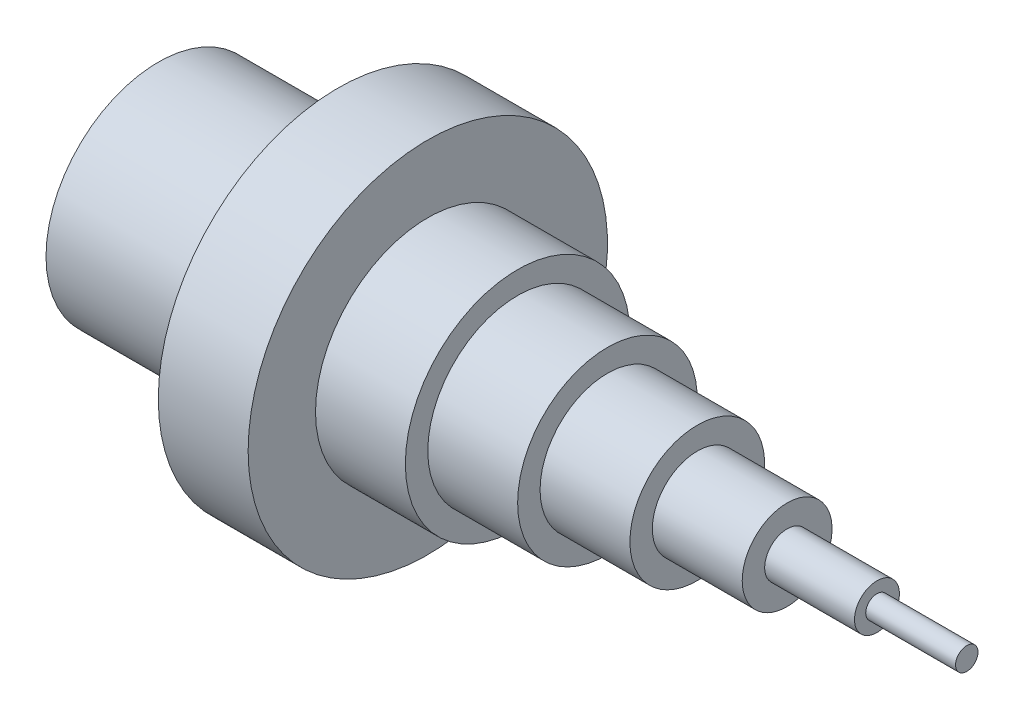
ISO-10303-21;
HEADER;
FILE_DESCRIPTION(('STEP AP214'),'2;1');
FILE_NAME('part.step','',(''),(''),'','','');
FILE_SCHEMA(('AUTOMOTIVE_DESIGN { 1 0 10303 214 1 1 1 1 }'));
ENDSEC;
DATA;
#1=APPLICATION_CONTEXT('core data for automotive mechanical design processes');
#2=APPLICATION_PROTOCOL_DEFINITION('international standard','automotive_design',2000,#1);
#3=PRODUCT_CONTEXT('',#1,'mechanical');
#4=PRODUCT('Part','Part','',(#3));
#5=PRODUCT_RELATED_PRODUCT_CATEGORY('part','',(#4));
#6=PRODUCT_DEFINITION_FORMATION('','',#4);
#7=PRODUCT_DEFINITION_CONTEXT('part definition',#1,'design');
#8=PRODUCT_DEFINITION('design','',#6,#7);
#9=PRODUCT_DEFINITION_SHAPE('','',#8);
#10=(LENGTH_UNIT() NAMED_UNIT(*) SI_UNIT(.MILLI.,.METRE.));
#11=(NAMED_UNIT(*) PLANE_ANGLE_UNIT() SI_UNIT($,.RADIAN.));
#12=(NAMED_UNIT(*) SI_UNIT($,.STERADIAN.) SOLID_ANGLE_UNIT());
#13=UNCERTAINTY_MEASURE_WITH_UNIT(LENGTH_MEASURE(1.E-05),#10,'distance_accuracy_value','');
#14=(GEOMETRIC_REPRESENTATION_CONTEXT(3) GLOBAL_UNCERTAINTY_ASSIGNED_CONTEXT((#13)) GLOBAL_UNIT_ASSIGNED_CONTEXT((#10,
#11,#12)) REPRESENTATION_CONTEXT('',''));
#15=CARTESIAN_POINT('',(0.,0.,0.));
#16=DIRECTION('',(0.,0.,1.));
#17=DIRECTION('',(1.,0.,0.));
#18=AXIS2_PLACEMENT_3D('',#15,#16,#17);
#19=CARTESIAN_POINT('',(0.,0.,0.));
#20=DIRECTION('',(-1.,0.,0.));
#21=DIRECTION('',(0.,0.,1.));
#22=AXIS2_PLACEMENT_3D('',#19,#20,#21);
#23=PLANE('',#22);
#24=CARTESIAN_POINT('',(0.,0.,0.));
#25=DIRECTION('',(-1.,0.,0.));
#26=DIRECTION('',(0.,0.,1.));
#27=AXIS2_PLACEMENT_3D('',#24,#25,#26);
#28=CIRCLE('',#27,2.5);
#29=CARTESIAN_POINT('',(0.,0.,2.5));
#30=VERTEX_POINT('',#29);
#31=EDGE_CURVE('E10',#30,#30,#28,.T.);
#32=ORIENTED_EDGE('',*,*,#31,.F.);
#33=EDGE_LOOP('',(#32));
#34=FACE_BOUND('',#33,.T.);
#35=ADVANCED_FACE('F37',(#34),#23,.F.);
#36=CARTESIAN_POINT('',(-180.,0.,0.));
#37=DIRECTION('',(-1.,0.,0.));
#38=DIRECTION('',(0.,0.,1.));
#39=AXIS2_PLACEMENT_3D('',#36,#37,#38);
#40=CYLINDRICAL_SURFACE('',#39,2.5);
#41=CARTESIAN_POINT('',(-20.,0.,0.));
#42=DIRECTION('',(-1.,0.,0.));
#43=DIRECTION('',(0.,0.,1.));
#44=AXIS2_PLACEMENT_3D('',#41,#42,#43);
#45=CIRCLE('',#44,2.5);
#46=CARTESIAN_POINT('',(-20.,0.,2.5));
#47=VERTEX_POINT('',#46);
#48=EDGE_CURVE('E44',#47,#47,#45,.T.);
#49=ORIENTED_EDGE('',*,*,#48,.F.);
#50=EDGE_LOOP('',(#49));
#51=FACE_BOUND('',#50,.T.);
#52=ORIENTED_EDGE('',*,*,#31,.T.);
#53=EDGE_LOOP('',(#52));
#54=FACE_BOUND('',#53,.T.);
#55=ADVANCED_FACE('F211',(#51,#54),#40,.T.);
#56=CARTESIAN_POINT('',(-20.,2.5,0.));
#57=DIRECTION('',(-1.,0.,0.));
#58=DIRECTION('',(0.,0.,1.));
#59=AXIS2_PLACEMENT_3D('',#56,#57,#58);
#60=PLANE('',#59);
#61=CARTESIAN_POINT('',(-20.,0.,0.));
#62=DIRECTION('',(-1.,0.,0.));
#63=DIRECTION('',(0.,0.,1.));
#64=AXIS2_PLACEMENT_3D('',#61,#62,#63);
#65=CIRCLE('',#64,4.99999999999999);
#66=CARTESIAN_POINT('',(-20.,0.,4.99999999999999));
#67=VERTEX_POINT('',#66);
#68=EDGE_CURVE('E49',#67,#67,#65,.T.);
#69=ORIENTED_EDGE('',*,*,#68,.F.);
#70=EDGE_LOOP('',(#69));
#71=FACE_BOUND('',#70,.T.);
#72=ORIENTED_EDGE('',*,*,#48,.T.);
#73=EDGE_LOOP('',(#72));
#74=FACE_BOUND('',#73,.T.);
#75=ADVANCED_FACE('F206',(#71,#74),#60,.F.);
#76=CARTESIAN_POINT('',(-180.,0.,0.));
#77=DIRECTION('',(-1.,0.,0.));
#78=DIRECTION('',(0.,0.,1.));
#79=AXIS2_PLACEMENT_3D('',#76,#77,#78);
#80=CYLINDRICAL_SURFACE('',#79,4.99999999999999);
#81=CARTESIAN_POINT('',(-40.,0.,0.));
#82=DIRECTION('',(-1.,0.,0.));
#83=DIRECTION('',(0.,0.,1.));
#84=AXIS2_PLACEMENT_3D('',#81,#82,#83);
#85=CIRCLE('',#84,4.99999999999999);
#86=CARTESIAN_POINT('',(-40.,0.,4.99999999999999));
#87=VERTEX_POINT('',#86);
#88=EDGE_CURVE('E54',#87,#87,#85,.T.);
#89=ORIENTED_EDGE('',*,*,#88,.F.);
#90=EDGE_LOOP('',(#89));
#91=FACE_BOUND('',#90,.T.);
#92=ORIENTED_EDGE('',*,*,#68,.T.);
#93=EDGE_LOOP('',(#92));
#94=FACE_BOUND('',#93,.T.);
#95=ADVANCED_FACE('F200',(#91,#94),#80,.T.);
#96=CARTESIAN_POINT('',(-40.,4.99999999999999,0.));
#97=DIRECTION('',(-1.,0.,0.));
#98=DIRECTION('',(0.,0.,1.));
#99=AXIS2_PLACEMENT_3D('',#96,#97,#98);
#100=PLANE('',#99);
#101=CARTESIAN_POINT('',(-40.,0.,0.));
#102=DIRECTION('',(-1.,0.,0.));
#103=DIRECTION('',(0.,0.,1.));
#104=AXIS2_PLACEMENT_3D('',#101,#102,#103);
#105=CIRCLE('',#104,9.99999999999999);
#106=CARTESIAN_POINT('',(-40.,0.,9.99999999999999));
#107=VERTEX_POINT('',#106);
#108=EDGE_CURVE('E60',#107,#107,#105,.T.);
#109=ORIENTED_EDGE('',*,*,#108,.F.);
#110=EDGE_LOOP('',(#109));
#111=FACE_BOUND('',#110,.T.);
#112=ORIENTED_EDGE('',*,*,#88,.T.);
#113=EDGE_LOOP('',(#112));
#114=FACE_BOUND('',#113,.T.);
#115=ADVANCED_FACE('F194',(#111,#114),#100,.F.);
#116=CARTESIAN_POINT('',(-180.,0.,0.));
#117=DIRECTION('',(-1.,0.,0.));
#118=DIRECTION('',(0.,0.,1.));
#119=AXIS2_PLACEMENT_3D('',#116,#117,#118);
#120=CYLINDRICAL_SURFACE('',#119,9.99999999999999);
#121=CARTESIAN_POINT('',(-60.,0.,0.));
#122=DIRECTION('',(-1.,0.,0.));
#123=DIRECTION('',(0.,0.,1.));
#124=AXIS2_PLACEMENT_3D('',#121,#122,#123);
#125=CIRCLE('',#124,9.99999999999998);
#126=CARTESIAN_POINT('',(-60.,0.,9.99999999999998));
#127=VERTEX_POINT('',#126);
#128=EDGE_CURVE('E64',#127,#127,#125,.T.);
#129=ORIENTED_EDGE('',*,*,#128,.F.);
#130=EDGE_LOOP('',(#129));
#131=FACE_BOUND('',#130,.T.);
#132=ORIENTED_EDGE('',*,*,#108,.T.);
#133=EDGE_LOOP('',(#132));
#134=FACE_BOUND('',#133,.T.);
#135=ADVANCED_FACE('F188',(#131,#134),#120,.T.);
#136=CARTESIAN_POINT('',(-60.,9.99999999999998,0.));
#137=DIRECTION('',(-1.,0.,0.));
#138=DIRECTION('',(0.,0.,1.));
#139=AXIS2_PLACEMENT_3D('',#136,#137,#138);
#140=PLANE('',#139);
#141=CARTESIAN_POINT('',(-60.,0.,0.));
#142=DIRECTION('',(-1.,0.,0.));
#143=DIRECTION('',(0.,0.,1.));
#144=AXIS2_PLACEMENT_3D('',#141,#142,#143);
#145=CIRCLE('',#144,15.);
#146=CARTESIAN_POINT('',(-60.,0.,15.));
#147=VERTEX_POINT('',#146);
#148=EDGE_CURVE('E68',#147,#147,#145,.T.);
#149=ORIENTED_EDGE('',*,*,#148,.F.);
#150=EDGE_LOOP('',(#149));
#151=FACE_BOUND('',#150,.T.);
#152=ORIENTED_EDGE('',*,*,#128,.T.);
#153=EDGE_LOOP('',(#152));
#154=FACE_BOUND('',#153,.T.);
#155=ADVANCED_FACE('F182',(#151,#154),#140,.F.);
#156=CARTESIAN_POINT('',(-180.,0.,0.));
#157=DIRECTION('',(-1.,0.,0.));
#158=DIRECTION('',(0.,0.,1.));
#159=AXIS2_PLACEMENT_3D('',#156,#157,#158);
#160=CYLINDRICAL_SURFACE('',#159,15.);
#161=CARTESIAN_POINT('',(-80.,0.,0.));
#162=DIRECTION('',(-1.,0.,0.));
#163=DIRECTION('',(0.,0.,1.));
#164=AXIS2_PLACEMENT_3D('',#161,#162,#163);
#165=CIRCLE('',#164,15.);
#166=CARTESIAN_POINT('',(-80.,0.,15.));
#167=VERTEX_POINT('',#166);
#168=EDGE_CURVE('E72',#167,#167,#165,.T.);
#169=ORIENTED_EDGE('',*,*,#168,.F.);
#170=EDGE_LOOP('',(#169));
#171=FACE_BOUND('',#170,.T.);
#172=ORIENTED_EDGE('',*,*,#148,.T.);
#173=EDGE_LOOP('',(#172));
#174=FACE_BOUND('',#173,.T.);
#175=ADVANCED_FACE('F176',(#171,#174),#160,.T.);
#176=CARTESIAN_POINT('',(-80.,15.,0.));
#177=DIRECTION('',(-1.,0.,0.));
#178=DIRECTION('',(0.,0.,1.));
#179=AXIS2_PLACEMENT_3D('',#176,#177,#178);
#180=PLANE('',#179);
#181=CARTESIAN_POINT('',(-80.,0.,0.));
#182=DIRECTION('',(-1.,0.,0.));
#183=DIRECTION('',(0.,0.,1.));
#184=AXIS2_PLACEMENT_3D('',#181,#182,#183);
#185=CIRCLE('',#184,20.);
#186=CARTESIAN_POINT('',(-80.,0.,20.));
#187=VERTEX_POINT('',#186);
#188=EDGE_CURVE('E76',#187,#187,#185,.T.);
#189=ORIENTED_EDGE('',*,*,#188,.F.);
#190=EDGE_LOOP('',(#189));
#191=FACE_BOUND('',#190,.T.);
#192=ORIENTED_EDGE('',*,*,#168,.T.);
#193=EDGE_LOOP('',(#192));
#194=FACE_BOUND('',#193,.T.);
#195=ADVANCED_FACE('F170',(#191,#194),#180,.F.);
#196=CARTESIAN_POINT('',(-180.,0.,0.));
#197=DIRECTION('',(-1.,0.,0.));
#198=DIRECTION('',(0.,0.,1.));
#199=AXIS2_PLACEMENT_3D('',#196,#197,#198);
#200=CYLINDRICAL_SURFACE('',#199,20.);
#201=CARTESIAN_POINT('',(-100.,0.,0.));
#202=DIRECTION('',(-1.,0.,0.));
#203=DIRECTION('',(0.,0.,1.));
#204=AXIS2_PLACEMENT_3D('',#201,#202,#203);
#205=CIRCLE('',#204,20.);
#206=CARTESIAN_POINT('',(-100.,0.,20.));
#207=VERTEX_POINT('',#206);
#208=EDGE_CURVE('E80',#207,#207,#205,.T.);
#209=ORIENTED_EDGE('',*,*,#208,.F.);
#210=EDGE_LOOP('',(#209));
#211=FACE_BOUND('',#210,.T.);
#212=ORIENTED_EDGE('',*,*,#188,.T.);
#213=EDGE_LOOP('',(#212));
#214=FACE_BOUND('',#213,.T.);
#215=ADVANCED_FACE('F164',(#211,#214),#200,.T.);
#216=CARTESIAN_POINT('',(-100.,20.,0.));
#217=DIRECTION('',(-1.,0.,0.));
#218=DIRECTION('',(0.,0.,1.));
#219=AXIS2_PLACEMENT_3D('',#216,#217,#218);
#220=PLANE('',#219);
#221=CARTESIAN_POINT('',(-100.,0.,0.));
#222=DIRECTION('',(-1.,0.,0.));
#223=DIRECTION('',(0.,0.,1.));
#224=AXIS2_PLACEMENT_3D('',#221,#222,#223);
#225=CIRCLE('',#224,25.);
#226=CARTESIAN_POINT('',(-100.,0.,25.));
#227=VERTEX_POINT('',#226);
#228=EDGE_CURVE('E84',#227,#227,#225,.T.);
#229=ORIENTED_EDGE('',*,*,#228,.F.);
#230=EDGE_LOOP('',(#229));
#231=FACE_BOUND('',#230,.T.);
#232=ORIENTED_EDGE('',*,*,#208,.T.);
#233=EDGE_LOOP('',(#232));
#234=FACE_BOUND('',#233,.T.);
#235=ADVANCED_FACE('F158',(#231,#234),#220,.F.);
#236=CARTESIAN_POINT('',(-180.,0.,0.));
#237=DIRECTION('',(-1.,0.,0.));
#238=DIRECTION('',(0.,0.,1.));
#239=AXIS2_PLACEMENT_3D('',#236,#237,#238);
#240=CYLINDRICAL_SURFACE('',#239,25.);
#241=CARTESIAN_POINT('',(-120.,0.,0.));
#242=DIRECTION('',(-1.,0.,0.));
#243=DIRECTION('',(0.,0.,1.));
#244=AXIS2_PLACEMENT_3D('',#241,#242,#243);
#245=CIRCLE('',#244,25.);
#246=CARTESIAN_POINT('',(-120.,0.,25.));
#247=VERTEX_POINT('',#246);
#248=EDGE_CURVE('E88',#247,#247,#245,.T.);
#249=ORIENTED_EDGE('',*,*,#248,.F.);
#250=EDGE_LOOP('',(#249));
#251=FACE_BOUND('',#250,.T.);
#252=ORIENTED_EDGE('',*,*,#228,.T.);
#253=EDGE_LOOP('',(#252));
#254=FACE_BOUND('',#253,.T.);
#255=ADVANCED_FACE('F152',(#251,#254),#240,.T.);
#256=CARTESIAN_POINT('',(-120.,25.,0.));
#257=DIRECTION('',(-1.,0.,0.));
#258=DIRECTION('',(0.,0.,1.));
#259=AXIS2_PLACEMENT_3D('',#256,#257,#258);
#260=PLANE('',#259);
#261=CARTESIAN_POINT('',(-120.,0.,0.));
#262=DIRECTION('',(-1.,0.,0.));
#263=DIRECTION('',(0.,0.,1.));
#264=AXIS2_PLACEMENT_3D('',#261,#262,#263);
#265=CIRCLE('',#264,40.);
#266=CARTESIAN_POINT('',(-120.,0.,40.));
#267=VERTEX_POINT('',#266);
#268=EDGE_CURVE('E92',#267,#267,#265,.T.);
#269=ORIENTED_EDGE('',*,*,#268,.F.);
#270=EDGE_LOOP('',(#269));
#271=FACE_BOUND('',#270,.T.);
#272=ORIENTED_EDGE('',*,*,#248,.T.);
#273=EDGE_LOOP('',(#272));
#274=FACE_BOUND('',#273,.T.);
#275=ADVANCED_FACE('F146',(#271,#274),#260,.F.);
#276=CARTESIAN_POINT('',(-180.,0.,0.));
#277=DIRECTION('',(-1.,0.,0.));
#278=DIRECTION('',(0.,0.,1.));
#279=AXIS2_PLACEMENT_3D('',#276,#277,#278);
#280=CYLINDRICAL_SURFACE('',#279,40.);
#281=CARTESIAN_POINT('',(-140.,0.,0.));
#282=DIRECTION('',(-1.,0.,0.));
#283=DIRECTION('',(0.,0.,1.));
#284=AXIS2_PLACEMENT_3D('',#281,#282,#283);
#285=CIRCLE('',#284,40.);
#286=CARTESIAN_POINT('',(-140.,0.,40.));
#287=VERTEX_POINT('',#286);
#288=EDGE_CURVE('E96',#287,#287,#285,.T.);
#289=ORIENTED_EDGE('',*,*,#288,.F.);
#290=EDGE_LOOP('',(#289));
#291=FACE_BOUND('',#290,.T.);
#292=ORIENTED_EDGE('',*,*,#268,.T.);
#293=EDGE_LOOP('',(#292));
#294=FACE_BOUND('',#293,.T.);
#295=ADVANCED_FACE('F140',(#291,#294),#280,.T.);
#296=CARTESIAN_POINT('',(-140.,40.,0.));
#297=DIRECTION('',(1.,0.,0.));
#298=DIRECTION('',(0.,0.,-1.));
#299=AXIS2_PLACEMENT_3D('',#296,#297,#298);
#300=PLANE('',#299);
#301=CARTESIAN_POINT('',(-140.,0.,0.));
#302=DIRECTION('',(-1.,0.,0.));
#303=DIRECTION('',(0.,0.,1.));
#304=AXIS2_PLACEMENT_3D('',#301,#302,#303);
#305=CIRCLE('',#304,25.);
#306=CARTESIAN_POINT('',(-140.,0.,25.));
#307=VERTEX_POINT('',#306);
#308=EDGE_CURVE('E100',#307,#307,#305,.T.);
#309=ORIENTED_EDGE('',*,*,#308,.F.);
#310=EDGE_LOOP('',(#309));
#311=FACE_BOUND('',#310,.T.);
#312=ORIENTED_EDGE('',*,*,#288,.T.);
#313=EDGE_LOOP('',(#312));
#314=FACE_BOUND('',#313,.T.);
#315=ADVANCED_FACE('F134',(#311,#314),#300,.F.);
#316=CARTESIAN_POINT('',(-180.,0.,0.));
#317=DIRECTION('',(-1.,0.,0.));
#318=DIRECTION('',(0.,0.,1.));
#319=AXIS2_PLACEMENT_3D('',#316,#317,#318);
#320=CYLINDRICAL_SURFACE('',#319,25.);
#321=CARTESIAN_POINT('',(-180.,0.,0.));
#322=DIRECTION('',(-1.,0.,0.));
#323=DIRECTION('',(0.,0.,1.));
#324=AXIS2_PLACEMENT_3D('',#321,#322,#323);
#325=CIRCLE('',#324,25.);
#326=CARTESIAN_POINT('',(-180.,0.,25.));
#327=VERTEX_POINT('',#326);
#328=EDGE_CURVE('E104',#327,#327,#325,.T.);
#329=ORIENTED_EDGE('',*,*,#328,.F.);
#330=EDGE_LOOP('',(#329));
#331=FACE_BOUND('',#330,.T.);
#332=ORIENTED_EDGE('',*,*,#308,.T.);
#333=EDGE_LOOP('',(#332));
#334=FACE_BOUND('',#333,.T.);
#335=ADVANCED_FACE('F128',(#331,#334),#320,.T.);
#336=CARTESIAN_POINT('',(-180.,25.,0.));
#337=DIRECTION('',(1.,0.,0.));
#338=DIRECTION('',(0.,0.,-1.));
#339=AXIS2_PLACEMENT_3D('',#336,#337,#338);
#340=PLANE('',#339);
#341=CARTESIAN_POINT('',(-180.,0.,0.));
#342=DIRECTION('',(-1.,0.,0.));
#343=DIRECTION('',(0.,0.,1.));
#344=AXIS2_PLACEMENT_3D('',#341,#342,#343);
#345=CIRCLE('',#344,20.);
#346=CARTESIAN_POINT('',(-180.,0.,20.));
#347=VERTEX_POINT('',#346);
#348=EDGE_CURVE('E109',#347,#347,#345,.T.);
#349=ORIENTED_EDGE('',*,*,#348,.F.);
#350=EDGE_LOOP('',(#349));
#351=FACE_BOUND('',#350,.T.);
#352=ORIENTED_EDGE('',*,*,#328,.T.);
#353=EDGE_LOOP('',(#352));
#354=FACE_BOUND('',#353,.T.);
#355=ADVANCED_FACE('F122',(#351,#354),#340,.F.);
#356=CARTESIAN_POINT('',(-140.,0.,0.));
#357=DIRECTION('',(-1.,0.,0.));
#358=DIRECTION('',(0.,0.,1.));
#359=AXIS2_PLACEMENT_3D('',#356,#357,#358);
#360=CYLINDRICAL_SURFACE('',#359,20.);
#361=CARTESIAN_POINT('',(-140.,0.,0.));
#362=DIRECTION('',(-1.,0.,0.));
#363=DIRECTION('',(0.,0.,1.));
#364=AXIS2_PLACEMENT_3D('',#361,#362,#363);
#365=CIRCLE('',#364,20.);
#366=CARTESIAN_POINT('',(-140.,0.,20.));
#367=VERTEX_POINT('',#366);
#368=EDGE_CURVE('E108',#367,#367,#365,.T.);
#369=ORIENTED_EDGE('',*,*,#368,.F.);
#370=EDGE_LOOP('',(#369));
#371=FACE_BOUND('',#370,.T.);
#372=ORIENTED_EDGE('',*,*,#348,.T.);
#373=EDGE_LOOP('',(#372));
#374=FACE_BOUND('',#373,.T.);
#375=ADVANCED_FACE('F119',(#371,#374),#360,.F.);
#376=CARTESIAN_POINT('',(-140.,0.,0.));
#377=DIRECTION('',(-1.,0.,0.));
#378=DIRECTION('',(0.,0.,1.));
#379=AXIS2_PLACEMENT_3D('',#376,#377,#378);
#380=PLANE('',#379);
#381=ORIENTED_EDGE('',*,*,#368,.T.);
#382=EDGE_LOOP('',(#381));
#383=FACE_BOUND('',#382,.T.);
#384=ADVANCED_FACE('F117',(#383),#380,.T.);
#385=CLOSED_SHELL('',(#35,#55,#75,#95,#115,#135,#155,#175,#195,#215,#235,#255,#275,#295,#315,
#335,#355,#375,#384));
#386=MANIFOLD_SOLID_BREP('B2',#385);
#387=ADVANCED_BREP_SHAPE_REPRESENTATION('',(#18,#386),#14);
#388=SHAPE_DEFINITION_REPRESENTATION(#9,#387);
ENDSEC;
END-ISO-10303-21;
